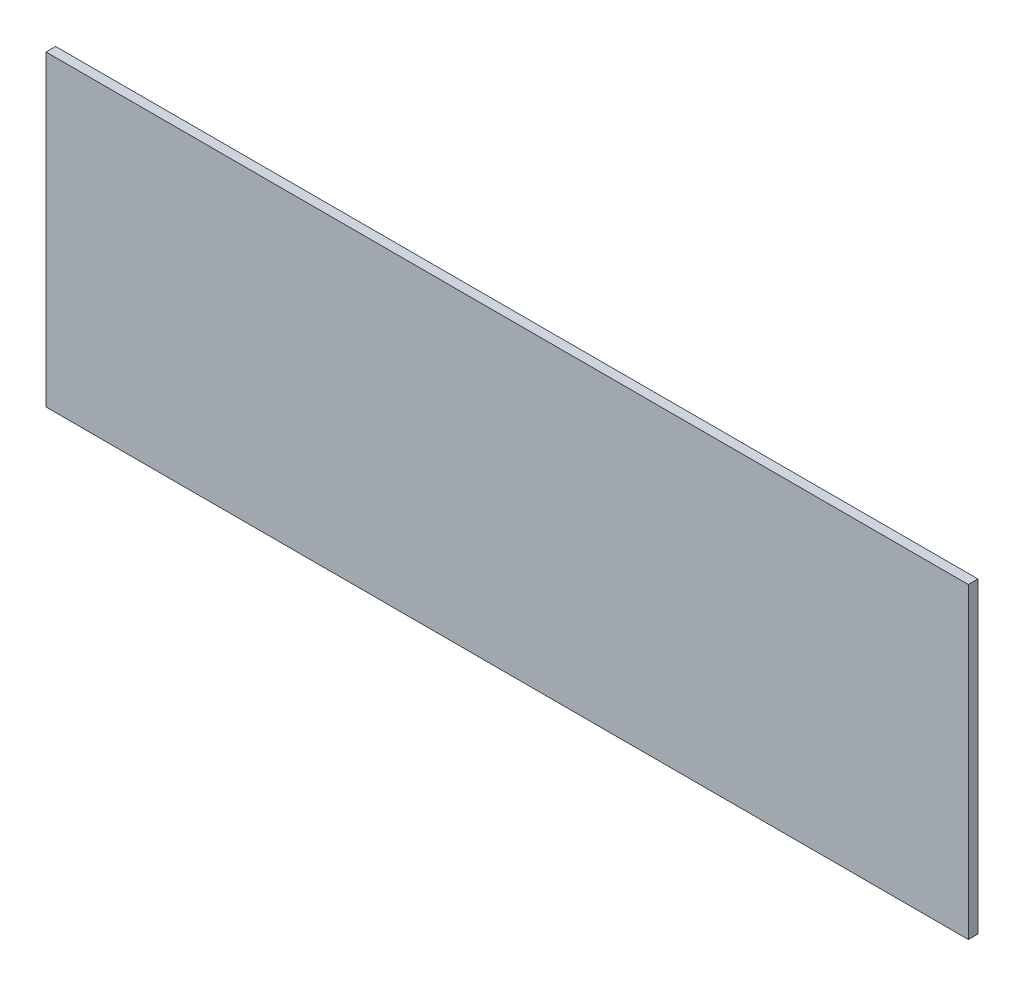
ISO-10303-21;
HEADER;
FILE_DESCRIPTION(('STEP AP214'),'2;1');
FILE_NAME('part.step','',(''),(''),'','','');
FILE_SCHEMA(('AUTOMOTIVE_DESIGN { 1 0 10303 214 1 1 1 1 }'));
ENDSEC;
DATA;
#1=APPLICATION_CONTEXT('core data for automotive mechanical design processes');
#2=APPLICATION_PROTOCOL_DEFINITION('international standard','automotive_design',2000,#1);
#3=PRODUCT_CONTEXT('',#1,'mechanical');
#4=PRODUCT('Part','Part','',(#3));
#5=PRODUCT_RELATED_PRODUCT_CATEGORY('part','',(#4));
#6=PRODUCT_DEFINITION_FORMATION('','',#4);
#7=PRODUCT_DEFINITION_CONTEXT('part definition',#1,'design');
#8=PRODUCT_DEFINITION('design','',#6,#7);
#9=PRODUCT_DEFINITION_SHAPE('','',#8);
#10=(LENGTH_UNIT() NAMED_UNIT(*) SI_UNIT(.MILLI.,.METRE.));
#11=(NAMED_UNIT(*) PLANE_ANGLE_UNIT() SI_UNIT($,.RADIAN.));
#12=(NAMED_UNIT(*) SI_UNIT($,.STERADIAN.) SOLID_ANGLE_UNIT());
#13=UNCERTAINTY_MEASURE_WITH_UNIT(LENGTH_MEASURE(1.E-05),#10,'distance_accuracy_value','');
#14=(GEOMETRIC_REPRESENTATION_CONTEXT(3) GLOBAL_UNCERTAINTY_ASSIGNED_CONTEXT((#13)) GLOBAL_UNIT_ASSIGNED_CONTEXT((#10,
#11,#12)) REPRESENTATION_CONTEXT('',''));
#15=CARTESIAN_POINT('',(0.,0.,0.));
#16=DIRECTION('',(0.,0.,1.));
#17=DIRECTION('',(1.,0.,0.));
#18=AXIS2_PLACEMENT_3D('',#15,#16,#17);
#19=CARTESIAN_POINT('',(152.4,-50.8,3.175));
#20=DIRECTION('',(-1.,0.,0.));
#21=DIRECTION('',(0.,0.,1.));
#22=AXIS2_PLACEMENT_3D('',#19,#20,#21);
#23=PLANE('',#22);
#24=DIRECTION('',(0.,1.,0.));
#25=VECTOR('',#24,1.);
#26=CARTESIAN_POINT('',(152.4,-50.8,0.));
#27=LINE('',#26,#25);
#28=CARTESIAN_POINT('',(152.4,-50.8,0.));
#29=VERTEX_POINT('',#28);
#30=CARTESIAN_POINT('',(152.4,50.8,0.));
#31=VERTEX_POINT('',#30);
#32=EDGE_CURVE('E96',#29,#31,#27,.T.);
#33=ORIENTED_EDGE('',*,*,#32,.T.);
#34=DIRECTION('',(0.,0.,-1.));
#35=VECTOR('',#34,1.);
#36=CARTESIAN_POINT('',(152.4,50.8,3.175));
#37=LINE('',#36,#35);
#38=CARTESIAN_POINT('',(152.4,50.8,3.175));
#39=VERTEX_POINT('',#38);
#40=EDGE_CURVE('E11',#39,#31,#37,.T.);
#41=ORIENTED_EDGE('',*,*,#40,.F.);
#42=DIRECTION('',(0.,1.,0.));
#43=VECTOR('',#42,1.);
#44=CARTESIAN_POINT('',(152.4,-50.8,3.175));
#45=LINE('',#44,#43);
#46=CARTESIAN_POINT('',(152.4,-50.8,3.175));
#47=VERTEX_POINT('',#46);
#48=EDGE_CURVE('E84',#47,#39,#45,.T.);
#49=ORIENTED_EDGE('',*,*,#48,.F.);
#50=DIRECTION('',(0.,0.,-1.));
#51=VECTOR('',#50,1.);
#52=CARTESIAN_POINT('',(152.4,-50.8,3.175));
#53=LINE('',#52,#51);
#54=EDGE_CURVE('E92',#47,#29,#53,.T.);
#55=ORIENTED_EDGE('',*,*,#54,.T.);
#56=EDGE_LOOP('',(#33,#41,#49,#55));
#57=FACE_BOUND('',#56,.T.);
#58=ADVANCED_FACE('F33',(#57),#23,.F.);
#59=CARTESIAN_POINT('',(-152.4,50.8,3.175));
#60=DIRECTION('',(0.,-1.,0.));
#61=DIRECTION('',(0.,0.,-1.));
#62=AXIS2_PLACEMENT_3D('',#59,#60,#61);
#63=PLANE('',#62);
#64=DIRECTION('',(-1.,0.,0.));
#65=VECTOR('',#64,1.);
#66=CARTESIAN_POINT('',(-152.4,50.8,0.));
#67=LINE('',#66,#65);
#68=CARTESIAN_POINT('',(-152.4,50.8,0.));
#69=VERTEX_POINT('',#68);
#70=EDGE_CURVE('E88',#31,#69,#67,.T.);
#71=ORIENTED_EDGE('',*,*,#70,.T.);
#72=DIRECTION('',(0.,0.,-1.));
#73=VECTOR('',#72,1.);
#74=CARTESIAN_POINT('',(-152.4,50.8,3.175));
#75=LINE('',#74,#73);
#76=CARTESIAN_POINT('',(-152.4,50.8,3.175));
#77=VERTEX_POINT('',#76);
#78=EDGE_CURVE('E41',#77,#69,#75,.T.);
#79=ORIENTED_EDGE('',*,*,#78,.F.);
#80=DIRECTION('',(-1.,0.,0.));
#81=VECTOR('',#80,1.);
#82=CARTESIAN_POINT('',(-152.4,50.8,3.175));
#83=LINE('',#82,#81);
#84=EDGE_CURVE('E79',#39,#77,#83,.T.);
#85=ORIENTED_EDGE('',*,*,#84,.F.);
#86=ORIENTED_EDGE('',*,*,#40,.T.);
#87=EDGE_LOOP('',(#71,#79,#85,#86));
#88=FACE_BOUND('',#87,.T.);
#89=ADVANCED_FACE('F87',(#88),#63,.F.);
#90=CARTESIAN_POINT('',(-152.4,-50.8,3.175));
#91=DIRECTION('',(1.,0.,0.));
#92=DIRECTION('',(0.,0.,-1.));
#93=AXIS2_PLACEMENT_3D('',#90,#91,#92);
#94=PLANE('',#93);
#95=DIRECTION('',(0.,-1.,0.));
#96=VECTOR('',#95,1.);
#97=CARTESIAN_POINT('',(-152.4,-50.8,0.));
#98=LINE('',#97,#96);
#99=CARTESIAN_POINT('',(-152.4,-50.8,0.));
#100=VERTEX_POINT('',#99);
#101=EDGE_CURVE('E66',#69,#100,#98,.T.);
#102=ORIENTED_EDGE('',*,*,#101,.T.);
#103=DIRECTION('',(0.,0.,-1.));
#104=VECTOR('',#103,1.);
#105=CARTESIAN_POINT('',(-152.4,-50.8,3.175));
#106=LINE('',#105,#104);
#107=CARTESIAN_POINT('',(-152.4,-50.8,3.175));
#108=VERTEX_POINT('',#107);
#109=EDGE_CURVE('E89',#108,#100,#106,.T.);
#110=ORIENTED_EDGE('',*,*,#109,.F.);
#111=DIRECTION('',(0.,-1.,0.));
#112=VECTOR('',#111,1.);
#113=CARTESIAN_POINT('',(-152.4,-50.8,3.175));
#114=LINE('',#113,#112);
#115=EDGE_CURVE('E82',#77,#108,#114,.T.);
#116=ORIENTED_EDGE('',*,*,#115,.F.);
#117=ORIENTED_EDGE('',*,*,#78,.T.);
#118=EDGE_LOOP('',(#102,#110,#116,#117));
#119=FACE_BOUND('',#118,.T.);
#120=ADVANCED_FACE('F90',(#119),#94,.F.);
#121=CARTESIAN_POINT('',(-152.4,-50.8,3.175));
#122=DIRECTION('',(0.,1.,0.));
#123=DIRECTION('',(0.,0.,1.));
#124=AXIS2_PLACEMENT_3D('',#121,#122,#123);
#125=PLANE('',#124);
#126=DIRECTION('',(1.,0.,0.));
#127=VECTOR('',#126,1.);
#128=CARTESIAN_POINT('',(-152.4,-50.8,0.));
#129=LINE('',#128,#127);
#130=EDGE_CURVE('E72',#100,#29,#129,.T.);
#131=ORIENTED_EDGE('',*,*,#130,.T.);
#132=ORIENTED_EDGE('',*,*,#54,.F.);
#133=DIRECTION('',(1.,0.,0.));
#134=VECTOR('',#133,1.);
#135=CARTESIAN_POINT('',(-152.4,-50.8,3.175));
#136=LINE('',#135,#134);
#137=EDGE_CURVE('E49',#108,#47,#136,.T.);
#138=ORIENTED_EDGE('',*,*,#137,.F.);
#139=ORIENTED_EDGE('',*,*,#109,.T.);
#140=EDGE_LOOP('',(#131,#132,#138,#139));
#141=FACE_BOUND('',#140,.T.);
#142=ADVANCED_FACE('F103',(#141),#125,.F.);
#143=CARTESIAN_POINT('',(0.,0.,3.175));
#144=DIRECTION('',(0.,0.,-1.));
#145=DIRECTION('',(-1.,0.,0.));
#146=AXIS2_PLACEMENT_3D('',#143,#144,#145);
#147=PLANE('',#146);
#148=ORIENTED_EDGE('',*,*,#48,.T.);
#149=ORIENTED_EDGE('',*,*,#84,.T.);
#150=ORIENTED_EDGE('',*,*,#115,.T.);
#151=ORIENTED_EDGE('',*,*,#137,.T.);
#152=EDGE_LOOP('',(#148,#149,#150,#151));
#153=FACE_BOUND('',#152,.T.);
#154=ADVANCED_FACE('F80',(#153),#147,.F.);
#155=CARTESIAN_POINT('',(0.,0.,0.));
#156=DIRECTION('',(0.,0.,-1.));
#157=DIRECTION('',(-1.,0.,0.));
#158=AXIS2_PLACEMENT_3D('',#155,#156,#157);
#159=PLANE('',#158);
#160=ORIENTED_EDGE('',*,*,#32,.F.);
#161=ORIENTED_EDGE('',*,*,#130,.F.);
#162=ORIENTED_EDGE('',*,*,#101,.F.);
#163=ORIENTED_EDGE('',*,*,#70,.F.);
#164=EDGE_LOOP('',(#160,#161,#162,#163));
#165=FACE_BOUND('',#164,.T.);
#166=ADVANCED_FACE('F106',(#165),#159,.T.);
#167=CLOSED_SHELL('',(#58,#89,#120,#142,#154,#166));
#168=MANIFOLD_SOLID_BREP('B2',#167);
#169=ADVANCED_BREP_SHAPE_REPRESENTATION('',(#18,#168),#14);
#170=SHAPE_DEFINITION_REPRESENTATION(#9,#169);
ENDSEC;
END-ISO-10303-21;
